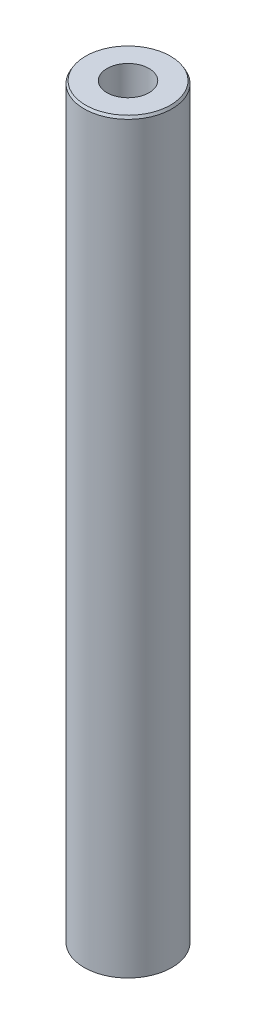
ISO-10303-21;
HEADER;
FILE_DESCRIPTION(('STEP AP214'),'2;1');
FILE_NAME('part.step','',(''),(''),'','','');
FILE_SCHEMA(('AUTOMOTIVE_DESIGN { 1 0 10303 214 1 1 1 1 }'));
ENDSEC;
DATA;
#1=APPLICATION_CONTEXT('core data for automotive mechanical design processes');
#2=APPLICATION_PROTOCOL_DEFINITION('international standard','automotive_design',2000,#1);
#3=PRODUCT_CONTEXT('',#1,'mechanical');
#4=PRODUCT('Part','Part','',(#3));
#5=PRODUCT_RELATED_PRODUCT_CATEGORY('part','',(#4));
#6=PRODUCT_DEFINITION_FORMATION('','',#4);
#7=PRODUCT_DEFINITION_CONTEXT('part definition',#1,'design');
#8=PRODUCT_DEFINITION('design','',#6,#7);
#9=PRODUCT_DEFINITION_SHAPE('','',#8);
#10=(LENGTH_UNIT() NAMED_UNIT(*) SI_UNIT(.MILLI.,.METRE.));
#11=(NAMED_UNIT(*) PLANE_ANGLE_UNIT() SI_UNIT($,.RADIAN.));
#12=(NAMED_UNIT(*) SI_UNIT($,.STERADIAN.) SOLID_ANGLE_UNIT());
#13=UNCERTAINTY_MEASURE_WITH_UNIT(LENGTH_MEASURE(1.E-05),#10,'distance_accuracy_value','');
#14=(GEOMETRIC_REPRESENTATION_CONTEXT(3) GLOBAL_UNCERTAINTY_ASSIGNED_CONTEXT((#13)) GLOBAL_UNIT_ASSIGNED_CONTEXT((#10,
#11,#12)) REPRESENTATION_CONTEXT('',''));
#15=CARTESIAN_POINT('',(0.,0.,0.));
#16=DIRECTION('',(0.,0.,1.));
#17=DIRECTION('',(1.,0.,0.));
#18=AXIS2_PLACEMENT_3D('',#15,#16,#17);
#19=CARTESIAN_POINT('',(0.,212.874090988298,0.));
#20=DIRECTION('',(0.,-1.,0.));
#21=DIRECTION('',(0.,0.,-1.));
#22=AXIS2_PLACEMENT_3D('',#19,#20,#21);
#23=CYLINDRICAL_SURFACE('',#22,12.5);
#24=CARTESIAN_POINT('',(0.,212.154304471255,0.));
#25=DIRECTION('',(0.,1.,0.));
#26=DIRECTION('',(0.,0.,1.));
#27=AXIS2_PLACEMENT_3D('',#24,#25,#26);
#28=CIRCLE('',#27,12.5);
#29=CARTESIAN_POINT('',(0.,212.154304471255,-12.5));
#30=VERTEX_POINT('',#29);
#31=EDGE_CURVE('E50',#30,#30,#28,.F.);
#32=ORIENTED_EDGE('',*,*,#31,.T.);
#33=EDGE_LOOP('',(#32));
#34=FACE_BOUND('',#33,.T.);
#35=CARTESIAN_POINT('',(0.,0.41556893937425,0.));
#36=DIRECTION('',(0.,1.,0.));
#37=DIRECTION('',(0.,0.,1.));
#38=AXIS2_PLACEMENT_3D('',#35,#36,#37);
#39=CIRCLE('',#38,12.5);
#40=CARTESIAN_POINT('',(0.,0.41556893937425,12.5));
#41=VERTEX_POINT('',#40);
#42=EDGE_CURVE('E51',#41,#41,#39,.T.);
#43=ORIENTED_EDGE('',*,*,#42,.T.);
#44=EDGE_LOOP('',(#43));
#45=FACE_BOUND('',#44,.T.);
#46=ADVANCED_FACE('F39',(#34,#45),#23,.T.);
#47=CARTESIAN_POINT('',(0.,212.874090988298,0.));
#48=DIRECTION('',(0.,1.,0.));
#49=DIRECTION('',(0.,0.,1.));
#50=AXIS2_PLACEMENT_3D('',#47,#48,#49);
#51=PLANE('',#50);
#52=CARTESIAN_POINT('',(0.,212.874090988298,0.));
#53=DIRECTION('',(0.,1.,0.));
#54=DIRECTION('',(0.,0.,1.));
#55=AXIS2_PLACEMENT_3D('',#52,#53,#54);
#56=CIRCLE('',#55,12.0844310606258);
#57=CARTESIAN_POINT('',(0.,212.874090988298,-12.0844310606258));
#58=VERTEX_POINT('',#57);
#59=EDGE_CURVE('E54',#58,#58,#56,.T.);
#60=ORIENTED_EDGE('',*,*,#59,.T.);
#61=EDGE_LOOP('',(#60));
#62=FACE_BOUND('',#61,.T.);
#63=CARTESIAN_POINT('',(0.,212.874090988298,0.));
#64=DIRECTION('',(0.,1.,0.));
#65=DIRECTION('',(0.,0.,1.));
#66=AXIS2_PLACEMENT_3D('',#63,#64,#65);
#67=CIRCLE('',#66,5.98916294107348);
#68=CARTESIAN_POINT('',(0.,212.874090988298,5.98916294107348));
#69=VERTEX_POINT('',#68);
#70=EDGE_CURVE('E58',#69,#69,#67,.T.);
#71=ORIENTED_EDGE('',*,*,#70,.F.);
#72=EDGE_LOOP('',(#71));
#73=FACE_BOUND('',#72,.T.);
#74=ADVANCED_FACE('F69',(#62,#73),#51,.T.);
#75=CARTESIAN_POINT('',(0.,0.,0.));
#76=DIRECTION('',(0.,1.,0.));
#77=DIRECTION('',(0.,0.,1.));
#78=AXIS2_PLACEMENT_3D('',#75,#76,#77);
#79=PLANE('',#78);
#80=CARTESIAN_POINT('',(0.,0.,0.));
#81=DIRECTION('',(0.,1.,0.));
#82=DIRECTION('',(0.,0.,1.));
#83=AXIS2_PLACEMENT_3D('',#80,#81,#82);
#84=CIRCLE('',#83,11.7802134829563);
#85=CARTESIAN_POINT('',(0.,0.,11.7802134829563));
#86=VERTEX_POINT('',#85);
#87=EDGE_CURVE('E10',#86,#86,#84,.F.);
#88=ORIENTED_EDGE('',*,*,#87,.T.);
#89=EDGE_LOOP('',(#88));
#90=FACE_BOUND('',#89,.T.);
#91=CARTESIAN_POINT('',(0.,0.,0.));
#92=DIRECTION('',(0.,1.,0.));
#93=DIRECTION('',(0.,0.,1.));
#94=AXIS2_PLACEMENT_3D('',#91,#92,#93);
#95=CIRCLE('',#94,5.98916294107348);
#96=CARTESIAN_POINT('',(0.,0.,5.98916294107348));
#97=VERTEX_POINT('',#96);
#98=EDGE_CURVE('E63',#97,#97,#95,.T.);
#99=ORIENTED_EDGE('',*,*,#98,.T.);
#100=EDGE_LOOP('',(#99));
#101=FACE_BOUND('',#100,.T.);
#102=ADVANCED_FACE('F75',(#90,#101),#79,.F.);
#103=CARTESIAN_POINT('',(0.,212.874090988298,0.));
#104=DIRECTION('',(0.,-1.,0.));
#105=DIRECTION('',(0.,0.,-1.));
#106=AXIS2_PLACEMENT_3D('',#103,#104,#105);
#107=CYLINDRICAL_SURFACE('',#106,5.98916294107348);
#108=ORIENTED_EDGE('',*,*,#70,.T.);
#109=EDGE_LOOP('',(#108));
#110=FACE_BOUND('',#109,.T.);
#111=ORIENTED_EDGE('',*,*,#98,.F.);
#112=EDGE_LOOP('',(#111));
#113=FACE_BOUND('',#112,.T.);
#114=ADVANCED_FACE('F70',(#110,#113),#107,.F.);
#115=CARTESIAN_POINT('',(0.,212.874090988298,0.));
#116=DIRECTION('',(0.,-1.,0.));
#117=DIRECTION('',(0.,0.,-1.));
#118=AXIS2_PLACEMENT_3D('',#115,#116,#117);
#119=CONICAL_SURFACE('',#118,12.0844310606258,0.523598775598304);
#120=CARTESIAN_POINT('',(0.,212.154304471255,-12.5));
#121=CARTESIAN_POINT('',(0.,212.161802247474,-12.4956711568815));
#122=CARTESIAN_POINT('',(0.,212.169300023693,-12.491342313763));
#123=CARTESIAN_POINT('',(0.,212.184295576131,-12.4826846275261));
#124=CARTESIAN_POINT('',(0.,212.191793352351,-12.4783557844076));
#125=CARTESIAN_POINT('',(0.,212.206788904789,-12.4696980981706));
#126=CARTESIAN_POINT('',(0.,212.214286681008,-12.4653692550522));
#127=CARTESIAN_POINT('',(0.,212.229282233447,-12.4567115688152));
#128=CARTESIAN_POINT('',(0.,212.236780009666,-12.4523827256967));
#129=CARTESIAN_POINT('',(0.,212.251775562104,-12.4437250394597));
#130=CARTESIAN_POINT('',(0.,212.259273338323,-12.4393961963413));
#131=CARTESIAN_POINT('',(0.,212.274268890762,-12.4307385101043));
#132=CARTESIAN_POINT('',(0.,212.281766666981,-12.4264096669858));
#133=CARTESIAN_POINT('',(0.,212.296762219419,-12.4177519807489));
#134=CARTESIAN_POINT('',(0.,212.304259995639,-12.4134231376304));
#135=CARTESIAN_POINT('',(0.,212.319255548077,-12.4047654513934));
#136=CARTESIAN_POINT('',(0.,212.326753324296,-12.4004366082749));
#137=CARTESIAN_POINT('',(0.,212.341748876735,-12.391778922038));
#138=CARTESIAN_POINT('',(0.,212.349246652954,-12.3874500789195));
#139=CARTESIAN_POINT('',(0.,212.364242205392,-12.3787923926825));
#140=CARTESIAN_POINT('',(0.,212.371739981612,-12.374463549564));
#141=CARTESIAN_POINT('',(0.,212.38673553405,-12.3658058633271));
#142=CARTESIAN_POINT('',(0.,212.394233310269,-12.3614770202086));
#143=CARTESIAN_POINT('',(0.,212.409228862708,-12.3528193339716));
#144=CARTESIAN_POINT('',(0.,212.416726638927,-12.3484904908532));
#145=CARTESIAN_POINT('',(0.,212.431722191365,-12.3398328046162));
#146=CARTESIAN_POINT('',(0.,212.439219967584,-12.3355039614977));
#147=CARTESIAN_POINT('',(0.,212.454215520023,-12.3268462752607));
#148=CARTESIAN_POINT('',(0.,212.461713296242,-12.3225174321423));
#149=CARTESIAN_POINT('',(0.,212.47670884868,-12.3138597459053));
#150=CARTESIAN_POINT('',(0.,212.4842066249,-12.3095309027868));
#151=CARTESIAN_POINT('',(0.,212.499202177338,-12.3008732165499));
#152=CARTESIAN_POINT('',(0.,212.506699953557,-12.2965443734314));
#153=CARTESIAN_POINT('',(0.,212.521695505996,-12.2878866871944));
#154=CARTESIAN_POINT('',(0.,212.529193282215,-12.2835578440759));
#155=CARTESIAN_POINT('',(0.,212.544188834653,-12.274900157839));
#156=CARTESIAN_POINT('',(0.,212.551686610872,-12.2705713147205));
#157=CARTESIAN_POINT('',(0.,212.566682163311,-12.2619136284835));
#158=CARTESIAN_POINT('',(0.,212.57417993953,-12.257584785365));
#159=CARTESIAN_POINT('',(0.,212.589175491968,-12.2489270991281));
#160=CARTESIAN_POINT('',(0.,212.596673268188,-12.2445982560096));
#161=CARTESIAN_POINT('',(0.,212.611668820626,-12.2359405697726));
#162=CARTESIAN_POINT('',(0.,212.619166596845,-12.2316117266541));
#163=CARTESIAN_POINT('',(0.,212.634162149284,-12.2229540404172));
#164=CARTESIAN_POINT('',(0.,212.641659925503,-12.2186251972987));
#165=CARTESIAN_POINT('',(0.,212.656655477941,-12.2099675110617));
#166=CARTESIAN_POINT('',(0.,212.664153254161,-12.2056386679433));
#167=CARTESIAN_POINT('',(0.,212.679148806599,-12.1969809817063));
#168=CARTESIAN_POINT('',(0.,212.686646582818,-12.1926521385878));
#169=CARTESIAN_POINT('',(0.,212.701642135257,-12.1839944523508));
#170=CARTESIAN_POINT('',(0.,212.709139911476,-12.1796656092324));
#171=CARTESIAN_POINT('',(0.,212.724135463914,-12.1710079229954));
#172=CARTESIAN_POINT('',(0.,212.731633240133,-12.1666790798769));
#173=CARTESIAN_POINT('',(0.,212.746628792572,-12.15802139364));
#174=CARTESIAN_POINT('',(0.,212.754126568791,-12.1536925505215));
#175=CARTESIAN_POINT('',(0.,212.769122121229,-12.1450348642845));
#176=CARTESIAN_POINT('',(0.,212.776619897449,-12.140706021166));
#177=CARTESIAN_POINT('',(0.,212.791615449887,-12.1320483349291));
#178=CARTESIAN_POINT('',(0.,212.799113226106,-12.1277194918106));
#179=CARTESIAN_POINT('',(0.,212.814108778545,-12.1190618055736));
#180=CARTESIAN_POINT('',(0.,212.821606554764,-12.1147329624551));
#181=CARTESIAN_POINT('',(0.,212.836602107202,-12.1060752762182));
#182=CARTESIAN_POINT('',(0.,212.844099883421,-12.1017464330997));
#183=CARTESIAN_POINT('',(0.,212.85909543586,-12.0930887468627));
#184=CARTESIAN_POINT('',(0.,212.866593212079,-12.0887599037442));
#185=CARTESIAN_POINT('',(0.,212.874090988298,-12.0844310606258));
#186=B_SPLINE_CURVE_WITH_KNOTS('',3,(#120,#121,#122,#123,#124,#125,#126,#127,#128,#129,#130,
#131,#132,#133,#134,#135,#136,#137,#138,#139,#140,#141,#142,#143,#144,#145,#146,#147,#148,#149,
#150,#151,#152,#153,#154,#155,#156,#157,#158,#159,#160,#161,#162,#163,#164,#165,#166,#167,#168,
#169,#170,#171,#172,#173,#174,#175,#176,#177,#178,#179,#180,#181,#182,#183,#184,#185),
.UNSPECIFIED.,.F.,.F.,(4,2,2,2,2,2,2,2,2,2,2,2,2,2,2,2,2,2,2,2,2,2,2,2,2,2,2,2,2,2,2,2,4),(0.,
0.0259730587109129,0.0519461174218009,0.0779191761326889,0.103892234843578,0.129865293554466,
0.155838352265354,0.181811410976243,0.207784469687131,0.233757528398019,0.259730587108907,
0.285703645819795,0.311676704530683,0.337649763241571,0.36362282195246,0.389595880663348,
0.415568939374236,0.441541998085149,0.467515056796037,0.493488115506925,0.519461174217814,
0.545434232928702,0.57140729163959,0.597380350350479,0.623353409061367,0.649326467772255,
0.675299526483144,0.701272585194032,0.72724564390492,0.753218702615808,0.779191761326697,
0.805164820037585,0.831137878748497),.UNSPECIFIED.);
#187=EDGE_CURVE('BSEAM81',#30,#58,#186,.T.);
#188=ORIENTED_EDGE('',*,*,#31,.F.);
#189=ORIENTED_EDGE('',*,*,#59,.F.);
#190=ORIENTED_EDGE('',*,*,#187,.T.);
#191=ORIENTED_EDGE('',*,*,#187,.F.);
#192=EDGE_LOOP('',(#188,#190,#189,#191));
#193=FACE_BOUND('',#192,.T.);
#194=ADVANCED_FACE('F81',(#193),#119,.T.);
#195=CARTESIAN_POINT('',(0.,0.41556893937425,0.));
#196=DIRECTION('',(0.,1.,0.));
#197=DIRECTION('',(0.,0.,1.));
#198=AXIS2_PLACEMENT_3D('',#195,#196,#197);
#199=CONICAL_SURFACE('',#198,12.5,1.04719755119661);
#200=ORIENTED_EDGE('',*,*,#87,.F.);
#201=EDGE_LOOP('',(#200));
#202=FACE_BOUND('',#201,.T.);
#203=ORIENTED_EDGE('',*,*,#42,.F.);
#204=EDGE_LOOP('',(#203));
#205=FACE_BOUND('',#204,.T.);
#206=ADVANCED_FACE('F45',(#202,#205),#199,.T.);
#207=CLOSED_SHELL('',(#46,#74,#102,#114,#194,#206));
#208=MANIFOLD_SOLID_BREP('B2',#207);
#209=ADVANCED_BREP_SHAPE_REPRESENTATION('',(#18,#208),#14);
#210=SHAPE_DEFINITION_REPRESENTATION(#9,#209);
ENDSEC;
END-ISO-10303-21;
